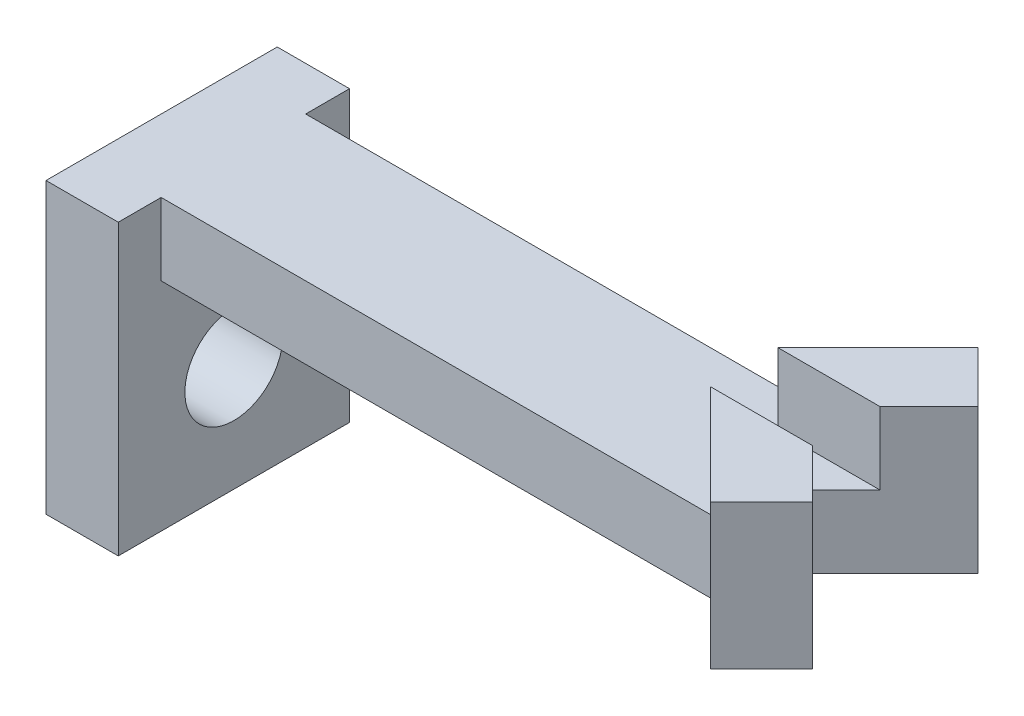
ISO-10303-21;
HEADER;
FILE_DESCRIPTION(('STEP AP214'),'2;1');
FILE_NAME('part.step','',(''),(''),'','','');
FILE_SCHEMA(('AUTOMOTIVE_DESIGN { 1 0 10303 214 1 1 1 1 }'));
ENDSEC;
DATA;
#1=APPLICATION_CONTEXT('core data for automotive mechanical design processes');
#2=APPLICATION_PROTOCOL_DEFINITION('international standard','automotive_design',2000,#1);
#3=PRODUCT_CONTEXT('',#1,'mechanical');
#4=PRODUCT('Part','Part','',(#3));
#5=PRODUCT_RELATED_PRODUCT_CATEGORY('part','',(#4));
#6=PRODUCT_DEFINITION_FORMATION('','',#4);
#7=PRODUCT_DEFINITION_CONTEXT('part definition',#1,'design');
#8=PRODUCT_DEFINITION('design','',#6,#7);
#9=PRODUCT_DEFINITION_SHAPE('','',#8);
#10=(LENGTH_UNIT() NAMED_UNIT(*) SI_UNIT(.MILLI.,.METRE.));
#11=(NAMED_UNIT(*) PLANE_ANGLE_UNIT() SI_UNIT($,.RADIAN.));
#12=(NAMED_UNIT(*) SI_UNIT($,.STERADIAN.) SOLID_ANGLE_UNIT());
#13=UNCERTAINTY_MEASURE_WITH_UNIT(LENGTH_MEASURE(1.E-05),#10,'distance_accuracy_value','');
#14=(GEOMETRIC_REPRESENTATION_CONTEXT(3) GLOBAL_UNCERTAINTY_ASSIGNED_CONTEXT((#13)) GLOBAL_UNIT_ASSIGNED_CONTEXT((#10,
#11,#12)) REPRESENTATION_CONTEXT('',''));
#15=CARTESIAN_POINT('',(0.,0.,0.));
#16=DIRECTION('',(0.,0.,1.));
#17=DIRECTION('',(1.,0.,0.));
#18=AXIS2_PLACEMENT_3D('',#15,#16,#17);
#19=CARTESIAN_POINT('',(0.,3.175,0.));
#20=DIRECTION('',(0.,-1.,0.));
#21=DIRECTION('',(0.,0.,-1.));
#22=AXIS2_PLACEMENT_3D('',#19,#20,#21);
#23=PLANE('',#22);
#24=DIRECTION('',(1.,0.,0.));
#25=VECTOR('',#24,1.);
#26=CARTESIAN_POINT('',(-11.4286567576271,3.175,-3.15452605038283));
#27=LINE('',#26,#25);
#28=CARTESIAN_POINT('',(-8.25365675762713,3.175,-3.15452605038283));
#29=VERTEX_POINT('',#28);
#30=CARTESIAN_POINT('',(15.8763432423729,3.175,-3.15452605038283));
#31=VERTEX_POINT('',#30);
#32=EDGE_CURVE('E285',#29,#31,#27,.T.);
#33=ORIENTED_EDGE('',*,*,#32,.F.);
#34=DIRECTION('',(0.,0.,-1.));
#35=VECTOR('',#34,1.);
#36=CARTESIAN_POINT('',(-8.25365675762713,3.175,-5.08));
#37=LINE('',#36,#35);
#38=CARTESIAN_POINT('',(-8.25365675762713,3.175,-5.08));
#39=VERTEX_POINT('',#38);
#40=EDGE_CURVE('E205',#29,#39,#37,.T.);
#41=ORIENTED_EDGE('',*,*,#40,.T.);
#42=DIRECTION('',(-1.,0.,0.));
#43=VECTOR('',#42,1.);
#44=CARTESIAN_POINT('',(-11.4286567576271,3.175,-5.08));
#45=LINE('',#44,#43);
#46=CARTESIAN_POINT('',(-11.4286567576271,3.175,-5.08));
#47=VERTEX_POINT('',#46);
#48=EDGE_CURVE('E165',#39,#47,#45,.T.);
#49=ORIENTED_EDGE('',*,*,#48,.T.);
#50=DIRECTION('',(0.,0.,1.));
#51=VECTOR('',#50,1.);
#52=CARTESIAN_POINT('',(-11.4286567576271,3.175,3.19547394961717));
#53=LINE('',#52,#51);
#54=CARTESIAN_POINT('',(-11.4286567576271,3.175,5.08));
#55=VERTEX_POINT('',#54);
#56=EDGE_CURVE('E313',#47,#55,#53,.T.);
#57=ORIENTED_EDGE('',*,*,#56,.T.);
#58=DIRECTION('',(1.,0.,0.));
#59=VECTOR('',#58,1.);
#60=CARTESIAN_POINT('',(-11.4286567576271,3.175,5.08));
#61=LINE('',#60,#59);
#62=CARTESIAN_POINT('',(-8.25365675762713,3.175,5.08));
#63=VERTEX_POINT('',#62);
#64=EDGE_CURVE('E188',#55,#63,#61,.T.);
#65=ORIENTED_EDGE('',*,*,#64,.T.);
#66=CARTESIAN_POINT('',(-8.25365675762713,3.175,3.19547394961717));
#67=VERTEX_POINT('',#66);
#68=EDGE_CURVE('E201',#63,#67,#37,.T.);
#69=ORIENTED_EDGE('',*,*,#68,.T.);
#70=DIRECTION('',(1.,0.,0.));
#71=VECTOR('',#70,1.);
#72=CARTESIAN_POINT('',(-11.4286567576271,3.175,3.19547394961717));
#73=LINE('',#72,#71);
#74=CARTESIAN_POINT('',(15.8763432423729,3.175,3.19547394961717));
#75=VERTEX_POINT('',#74);
#76=EDGE_CURVE('E56',#67,#75,#73,.T.);
#77=ORIENTED_EDGE('',*,*,#76,.T.);
#78=DIRECTION('',(0.707106781186548,0.,0.707106781186547));
#79=VECTOR('',#78,1.);
#80=CARTESIAN_POINT('',(18.580775447712,3.175,5.89990615495623));
#81=LINE('',#80,#79);
#82=CARTESIAN_POINT('',(14.1855372502087,3.175,1.50466795745288));
#83=VERTEX_POINT('',#82);
#84=EDGE_CURVE('E257',#83,#75,#81,.T.);
#85=ORIENTED_EDGE('',*,*,#84,.F.);
#86=DIRECTION('',(-1.,0.,0.));
#87=VECTOR('',#86,1.);
#88=CARTESIAN_POINT('',(14.1855372502087,3.175,1.50466795745288));
#89=LINE('',#88,#87);
#90=CARTESIAN_POINT('',(18.6756653107431,3.175,1.50466795745274));
#91=VERTEX_POINT('',#90);
#92=EDGE_CURVE('E251',#91,#83,#89,.T.);
#93=ORIENTED_EDGE('',*,*,#92,.F.);
#94=DIRECTION('',(-0.707106781186552,0.,-0.707106781186543));
#95=VECTOR('',#94,1.);
#96=CARTESIAN_POINT('',(20.8258394779794,3.175,3.65484212468901));
#97=LINE('',#96,#95);
#98=CARTESIAN_POINT('',(17.1914713029075,3.175,0.0204739496171711));
#99=VERTEX_POINT('',#98);
#100=EDGE_CURVE('E319',#91,#99,#97,.T.);
#101=ORIENTED_EDGE('',*,*,#100,.T.);
#102=DIRECTION('',(-0.707106781186552,0.,0.707106781186543));
#103=VECTOR('',#102,1.);
#104=CARTESIAN_POINT('',(20.8258394779794,3.175,-3.61389422545467));
#105=LINE('',#104,#103);
#106=CARTESIAN_POINT('',(18.6756653107431,3.175,-1.4637200582184));
#107=VERTEX_POINT('',#106);
#108=EDGE_CURVE('E282',#107,#99,#105,.T.);
#109=ORIENTED_EDGE('',*,*,#108,.F.);
#110=DIRECTION('',(1.,0.,0.));
#111=VECTOR('',#110,1.);
#112=CARTESIAN_POINT('',(14.1855372502087,3.175,-1.46372005821854));
#113=LINE('',#112,#111);
#114=CARTESIAN_POINT('',(14.1855372502087,3.175,-1.46372005821854));
#115=VERTEX_POINT('',#114);
#116=EDGE_CURVE('E222',#115,#107,#113,.T.);
#117=ORIENTED_EDGE('',*,*,#116,.F.);
#118=DIRECTION('',(-0.707106781186547,0.,0.707106781186547));
#119=VECTOR('',#118,1.);
#120=CARTESIAN_POINT('',(18.580775447712,3.175,-5.85895825572189));
#121=LINE('',#120,#119);
#122=EDGE_CURVE('E228',#31,#115,#121,.T.);
#123=ORIENTED_EDGE('',*,*,#122,.F.);
#124=EDGE_LOOP('',(#33,#41,#49,#57,#65,#69,#77,#85,#93,#101,#109,#117,#123));
#125=FACE_BOUND('',#124,.T.);
#126=ADVANCED_FACE('F40',(#125),#23,.F.);
#127=CARTESIAN_POINT('',(-11.4286567576271,3.175,3.19547394961717));
#128=DIRECTION('',(1.,0.,0.));
#129=DIRECTION('',(0.,0.,-1.));
#130=AXIS2_PLACEMENT_3D('',#127,#128,#129);
#131=PLANE('',#130);
#132=CARTESIAN_POINT('',(-11.4286567576271,-4.7625,0.));
#133=DIRECTION('',(1.,0.,0.));
#134=DIRECTION('',(0.,0.,-1.));
#135=AXIS2_PLACEMENT_3D('',#132,#133,#134);
#136=CIRCLE('',#135,2.15265);
#137=CARTESIAN_POINT('',(-11.4286567576271,-4.7625,-2.15265));
#138=VERTEX_POINT('',#137);
#139=EDGE_CURVE('E194',#138,#138,#136,.T.);
#140=ORIENTED_EDGE('',*,*,#139,.T.);
#141=EDGE_LOOP('',(#140));
#142=FACE_BOUND('',#141,.T.);
#143=DIRECTION('',(0.,1.,0.));
#144=VECTOR('',#143,1.);
#145=CARTESIAN_POINT('',(-11.4286567576271,-9.525,5.08));
#146=LINE('',#145,#144);
#147=CARTESIAN_POINT('',(-11.4286567576271,-9.525,5.08));
#148=VERTEX_POINT('',#147);
#149=EDGE_CURVE('E211',#148,#55,#146,.T.);
#150=ORIENTED_EDGE('',*,*,#149,.T.);
#151=ORIENTED_EDGE('',*,*,#56,.F.);
#152=DIRECTION('',(0.,1.,0.));
#153=VECTOR('',#152,1.);
#154=CARTESIAN_POINT('',(-11.4286567576271,-9.525,-5.08));
#155=LINE('',#154,#153);
#156=CARTESIAN_POINT('',(-11.4286567576271,-9.525,-5.08));
#157=VERTEX_POINT('',#156);
#158=EDGE_CURVE('E170',#157,#47,#155,.T.);
#159=ORIENTED_EDGE('',*,*,#158,.F.);
#160=DIRECTION('',(0.,0.,1.));
#161=VECTOR('',#160,1.);
#162=CARTESIAN_POINT('',(-11.4286567576271,-9.525,-5.08));
#163=LINE('',#162,#161);
#164=EDGE_CURVE('E181',#157,#148,#163,.T.);
#165=ORIENTED_EDGE('',*,*,#164,.T.);
#166=EDGE_LOOP('',(#150,#151,#159,#165));
#167=FACE_BOUND('',#166,.T.);
#168=ADVANCED_FACE('F42',(#142,#167),#131,.F.);
#169=CARTESIAN_POINT('',(-11.4286567576271,3.175,3.19547394961717));
#170=DIRECTION('',(0.,0.,-1.));
#171=DIRECTION('',(-1.,0.,0.));
#172=AXIS2_PLACEMENT_3D('',#169,#170,#171);
#173=PLANE('',#172);
#174=ORIENTED_EDGE('',*,*,#76,.F.);
#175=DIRECTION('',(0.,-1.,0.));
#176=VECTOR('',#175,1.);
#177=CARTESIAN_POINT('',(-8.25365675762713,3.175,3.19547394961717));
#178=LINE('',#177,#176);
#179=CARTESIAN_POINT('',(-8.25365675762713,0.,3.19547394961717));
#180=VERTEX_POINT('',#179);
#181=EDGE_CURVE('E60',#67,#180,#178,.T.);
#182=ORIENTED_EDGE('',*,*,#181,.T.);
#183=DIRECTION('',(1.,0.,0.));
#184=VECTOR('',#183,1.);
#185=CARTESIAN_POINT('',(-11.4286567576271,0.,3.19547394961717));
#186=LINE('',#185,#184);
#187=CARTESIAN_POINT('',(15.8763432423729,0.,3.19547394961717));
#188=VERTEX_POINT('',#187);
#189=EDGE_CURVE('E312',#180,#188,#186,.T.);
#190=ORIENTED_EDGE('',*,*,#189,.T.);
#191=DIRECTION('',(0.,-1.,0.));
#192=VECTOR('',#191,1.);
#193=CARTESIAN_POINT('',(15.8763432423729,3.175,3.19547394961717));
#194=LINE('',#193,#192);
#195=EDGE_CURVE('E49',#75,#188,#194,.T.);
#196=ORIENTED_EDGE('',*,*,#195,.F.);
#197=EDGE_LOOP('',(#174,#182,#190,#196));
#198=FACE_BOUND('',#197,.T.);
#199=ADVANCED_FACE('F424',(#198),#173,.F.);
#200=CARTESIAN_POINT('',(15.8763432423729,3.175,3.19547394961717));
#201=DIRECTION('',(0.707106781186542,0.,-0.707106781186553));
#202=DIRECTION('',(-0.707106781186553,0.,-0.707106781186542));
#203=AXIS2_PLACEMENT_3D('',#200,#201,#202);
#204=PLANE('',#203);
#205=DIRECTION('',(0.707106781186553,0.,0.707106781186542));
#206=VECTOR('',#205,1.);
#207=CARTESIAN_POINT('',(15.8763432423729,0.,3.19547394961717));
#208=LINE('',#207,#206);
#209=CARTESIAN_POINT('',(18.5807754477121,0.,5.89990615495631));
#210=VERTEX_POINT('',#209);
#211=EDGE_CURVE('E326',#188,#210,#208,.T.);
#212=ORIENTED_EDGE('',*,*,#211,.T.);
#213=DIRECTION('',(0.,-1.,0.));
#214=VECTOR('',#213,1.);
#215=CARTESIAN_POINT('',(18.5807754477121,3.175,5.89990615495631));
#216=LINE('',#215,#214);
#217=CARTESIAN_POINT('',(18.580775447712,6.35,5.89990615495623));
#218=VERTEX_POINT('',#217);
#219=EDGE_CURVE('E341',#218,#210,#216,.T.);
#220=ORIENTED_EDGE('',*,*,#219,.F.);
#221=DIRECTION('',(0.707106781186548,0.,0.707106781186547));
#222=VECTOR('',#221,1.);
#223=CARTESIAN_POINT('',(18.580775447712,6.35,5.89990615495623));
#224=LINE('',#223,#222);
#225=CARTESIAN_POINT('',(14.1855372502087,6.35,1.50466795745288));
#226=VERTEX_POINT('',#225);
#227=EDGE_CURVE('E263',#226,#218,#224,.T.);
#228=ORIENTED_EDGE('',*,*,#227,.F.);
#229=DIRECTION('',(0.,-1.,0.));
#230=VECTOR('',#229,1.);
#231=CARTESIAN_POINT('',(14.1855372502087,6.35,1.50466795745288));
#232=LINE('',#231,#230);
#233=EDGE_CURVE('E267',#226,#83,#232,.T.);
#234=ORIENTED_EDGE('',*,*,#233,.T.);
#235=ORIENTED_EDGE('',*,*,#84,.T.);
#236=ORIENTED_EDGE('',*,*,#195,.T.);
#237=EDGE_LOOP('',(#212,#220,#228,#234,#235,#236));
#238=FACE_BOUND('',#237,.T.);
#239=ADVANCED_FACE('F348',(#238),#204,.F.);
#240=CARTESIAN_POINT('',(18.5807754477121,3.175,5.89990615495631));
#241=DIRECTION('',(-0.707106781186553,0.,-0.707106781186542));
#242=DIRECTION('',(-0.707106781186542,0.,0.707106781186553));
#243=AXIS2_PLACEMENT_3D('',#240,#241,#242);
#244=PLANE('',#243);
#245=DIRECTION('',(0.707106781186542,0.,-0.707106781186553));
#246=VECTOR('',#245,1.);
#247=CARTESIAN_POINT('',(18.5807754477121,0.,5.89990615495631));
#248=LINE('',#247,#246);
#249=CARTESIAN_POINT('',(20.8258394779794,0.,3.65484212468901));
#250=VERTEX_POINT('',#249);
#251=EDGE_CURVE('E329',#210,#250,#248,.T.);
#252=ORIENTED_EDGE('',*,*,#251,.T.);
#253=DIRECTION('',(0.,-1.,0.));
#254=VECTOR('',#253,1.);
#255=CARTESIAN_POINT('',(20.8258394779794,3.175,3.65484212468901));
#256=LINE('',#255,#254);
#257=CARTESIAN_POINT('',(20.8258394779794,6.35,3.65484212468901));
#258=VERTEX_POINT('',#257);
#259=EDGE_CURVE('E337',#258,#250,#256,.T.);
#260=ORIENTED_EDGE('',*,*,#259,.F.);
#261=DIRECTION('',(0.707106781186569,0.,-0.707106781186526));
#262=VECTOR('',#261,1.);
#263=CARTESIAN_POINT('',(20.8258394779794,6.35,3.65484212468901));
#264=LINE('',#263,#262);
#265=EDGE_CURVE('E252',#218,#258,#264,.T.);
#266=ORIENTED_EDGE('',*,*,#265,.F.);
#267=ORIENTED_EDGE('',*,*,#219,.T.);
#268=EDGE_LOOP('',(#252,#260,#266,#267));
#269=FACE_BOUND('',#268,.T.);
#270=ADVANCED_FACE('F354',(#269),#244,.F.);
#271=CARTESIAN_POINT('',(20.8258394779794,3.175,3.65484212468901));
#272=DIRECTION('',(-0.707106781186543,0.,0.707106781186552));
#273=DIRECTION('',(0.707106781186552,0.,0.707106781186543));
#274=AXIS2_PLACEMENT_3D('',#271,#272,#273);
#275=PLANE('',#274);
#276=DIRECTION('',(-0.707106781186552,0.,-0.707106781186543));
#277=VECTOR('',#276,1.);
#278=CARTESIAN_POINT('',(20.8258394779794,0.,3.65484212468901));
#279=LINE('',#278,#277);
#280=CARTESIAN_POINT('',(17.1914713029075,0.,0.0204739496171711));
#281=VERTEX_POINT('',#280);
#282=EDGE_CURVE('E316',#250,#281,#279,.T.);
#283=ORIENTED_EDGE('',*,*,#282,.T.);
#284=DIRECTION('',(0.,-1.,0.));
#285=VECTOR('',#284,1.);
#286=CARTESIAN_POINT('',(17.1914713029075,3.175,0.0204739496171711));
#287=LINE('',#286,#285);
#288=EDGE_CURVE('E323',#99,#281,#287,.T.);
#289=ORIENTED_EDGE('',*,*,#288,.F.);
#290=ORIENTED_EDGE('',*,*,#100,.F.);
#291=DIRECTION('',(0.,-1.,0.));
#292=VECTOR('',#291,1.);
#293=CARTESIAN_POINT('',(18.6756653107431,6.35,1.50466795745274));
#294=LINE('',#293,#292);
#295=CARTESIAN_POINT('',(18.6756653107431,6.35,1.50466795745274));
#296=VERTEX_POINT('',#295);
#297=EDGE_CURVE('E277',#296,#91,#294,.T.);
#298=ORIENTED_EDGE('',*,*,#297,.F.);
#299=DIRECTION('',(-0.707106781186552,0.,-0.707106781186543));
#300=VECTOR('',#299,1.);
#301=CARTESIAN_POINT('',(18.6756653107431,6.35,1.50466795745274));
#302=LINE('',#301,#300);
#303=EDGE_CURVE('E256',#258,#296,#302,.T.);
#304=ORIENTED_EDGE('',*,*,#303,.F.);
#305=ORIENTED_EDGE('',*,*,#259,.T.);
#306=EDGE_LOOP('',(#283,#289,#290,#298,#304,#305));
#307=FACE_BOUND('',#306,.T.);
#308=ADVANCED_FACE('F358',(#307),#275,.F.);
#309=CARTESIAN_POINT('',(0.,0.,0.));
#310=DIRECTION('',(0.,-1.,0.));
#311=DIRECTION('',(0.,0.,-1.));
#312=AXIS2_PLACEMENT_3D('',#309,#310,#311);
#313=PLANE('',#312);
#314=DIRECTION('',(0.,0.,1.));
#315=VECTOR('',#314,1.);
#316=CARTESIAN_POINT('',(-8.25365675762713,0.,0.));
#317=LINE('',#316,#315);
#318=CARTESIAN_POINT('',(-8.25365675762713,0.,-3.15452605038283));
#319=VERTEX_POINT('',#318);
#320=EDGE_CURVE('E210',#319,#180,#317,.T.);
#321=ORIENTED_EDGE('',*,*,#320,.F.);
#322=DIRECTION('',(1.,0.,0.));
#323=VECTOR('',#322,1.);
#324=CARTESIAN_POINT('',(-11.4286567576271,0.,-3.15452605038283));
#325=LINE('',#324,#323);
#326=CARTESIAN_POINT('',(15.8763432423729,0.,-3.15452605038283));
#327=VERTEX_POINT('',#326);
#328=EDGE_CURVE('E286',#319,#327,#325,.T.);
#329=ORIENTED_EDGE('',*,*,#328,.T.);
#330=DIRECTION('',(0.707106781186553,0.,-0.707106781186542));
#331=VECTOR('',#330,1.);
#332=CARTESIAN_POINT('',(15.8763432423729,0.,-3.15452605038283));
#333=LINE('',#332,#331);
#334=CARTESIAN_POINT('',(18.5807754477121,0.,-5.85895825572197));
#335=VERTEX_POINT('',#334);
#336=EDGE_CURVE('E297',#327,#335,#333,.T.);
#337=ORIENTED_EDGE('',*,*,#336,.T.);
#338=DIRECTION('',(0.707106781186542,0.,0.707106781186553));
#339=VECTOR('',#338,1.);
#340=CARTESIAN_POINT('',(18.5807754477121,0.,-5.85895825572197));
#341=LINE('',#340,#339);
#342=CARTESIAN_POINT('',(20.8258394779794,0.,-3.61389422545467));
#343=VERTEX_POINT('',#342);
#344=EDGE_CURVE('E293',#335,#343,#341,.T.);
#345=ORIENTED_EDGE('',*,*,#344,.T.);
#346=DIRECTION('',(-0.707106781186552,0.,0.707106781186543));
#347=VECTOR('',#346,1.);
#348=CARTESIAN_POINT('',(20.8258394779794,0.,-3.61389422545467));
#349=LINE('',#348,#347);
#350=EDGE_CURVE('E281',#343,#281,#349,.T.);
#351=ORIENTED_EDGE('',*,*,#350,.T.);
#352=ORIENTED_EDGE('',*,*,#282,.F.);
#353=ORIENTED_EDGE('',*,*,#251,.F.);
#354=ORIENTED_EDGE('',*,*,#211,.F.);
#355=ORIENTED_EDGE('',*,*,#189,.F.);
#356=EDGE_LOOP('',(#321,#329,#337,#345,#351,#352,#353,#354,#355));
#357=FACE_BOUND('',#356,.T.);
#358=ADVANCED_FACE('F351',(#357),#313,.T.);
#359=CARTESIAN_POINT('',(20.8258394779794,3.175,-3.61389422545467));
#360=DIRECTION('',(0.707106781186543,0.,0.707106781186552));
#361=DIRECTION('',(0.707106781186552,0.,-0.707106781186543));
#362=AXIS2_PLACEMENT_3D('',#359,#360,#361);
#363=PLANE('',#362);
#364=ORIENTED_EDGE('',*,*,#350,.F.);
#365=DIRECTION('',(0.,-1.,0.));
#366=VECTOR('',#365,1.);
#367=CARTESIAN_POINT('',(20.8258394779794,3.175,-3.61389422545467));
#368=LINE('',#367,#366);
#369=CARTESIAN_POINT('',(20.8258394779794,6.35,-3.61389422545467));
#370=VERTEX_POINT('',#369);
#371=EDGE_CURVE('E309',#370,#343,#368,.T.);
#372=ORIENTED_EDGE('',*,*,#371,.F.);
#373=DIRECTION('',(0.707106781186552,0.,-0.707106781186543));
#374=VECTOR('',#373,1.);
#375=CARTESIAN_POINT('',(18.6756653107431,6.35,-1.4637200582184));
#376=LINE('',#375,#374);
#377=CARTESIAN_POINT('',(18.6756653107431,6.35,-1.4637200582184));
#378=VERTEX_POINT('',#377);
#379=EDGE_CURVE('E227',#378,#370,#376,.T.);
#380=ORIENTED_EDGE('',*,*,#379,.F.);
#381=DIRECTION('',(0.,-1.,0.));
#382=VECTOR('',#381,1.);
#383=CARTESIAN_POINT('',(18.6756653107431,6.35,-1.4637200582184));
#384=LINE('',#383,#382);
#385=EDGE_CURVE('E248',#378,#107,#384,.T.);
#386=ORIENTED_EDGE('',*,*,#385,.T.);
#387=ORIENTED_EDGE('',*,*,#108,.T.);
#388=ORIENTED_EDGE('',*,*,#288,.T.);
#389=EDGE_LOOP('',(#364,#372,#380,#386,#387,#388));
#390=FACE_BOUND('',#389,.T.);
#391=ADVANCED_FACE('F373',(#390),#363,.T.);
#392=CARTESIAN_POINT('',(18.5807754477121,3.175,-5.85895825572197));
#393=DIRECTION('',(0.707106781186553,0.,-0.707106781186542));
#394=DIRECTION('',(-0.707106781186542,0.,-0.707106781186553));
#395=AXIS2_PLACEMENT_3D('',#392,#393,#394);
#396=PLANE('',#395);
#397=ORIENTED_EDGE('',*,*,#344,.F.);
#398=DIRECTION('',(0.,-1.,0.));
#399=VECTOR('',#398,1.);
#400=CARTESIAN_POINT('',(18.5807754477121,3.175,-5.85895825572197));
#401=LINE('',#400,#399);
#402=CARTESIAN_POINT('',(18.580775447712,6.35,-5.85895825572189));
#403=VERTEX_POINT('',#402);
#404=EDGE_CURVE('E306',#403,#335,#401,.T.);
#405=ORIENTED_EDGE('',*,*,#404,.F.);
#406=DIRECTION('',(-0.707106781186569,0.,-0.707106781186526));
#407=VECTOR('',#406,1.);
#408=CARTESIAN_POINT('',(18.580775447712,6.35,-5.85895825572189));
#409=LINE('',#408,#407);
#410=EDGE_CURVE('E232',#370,#403,#409,.T.);
#411=ORIENTED_EDGE('',*,*,#410,.F.);
#412=ORIENTED_EDGE('',*,*,#371,.T.);
#413=EDGE_LOOP('',(#397,#405,#411,#412));
#414=FACE_BOUND('',#413,.T.);
#415=ADVANCED_FACE('F377',(#414),#396,.T.);
#416=CARTESIAN_POINT('',(15.8763432423729,3.175,-3.15452605038283));
#417=DIRECTION('',(-0.707106781186542,0.,-0.707106781186553));
#418=DIRECTION('',(-0.707106781186553,0.,0.707106781186542));
#419=AXIS2_PLACEMENT_3D('',#416,#417,#418);
#420=PLANE('',#419);
#421=ORIENTED_EDGE('',*,*,#336,.F.);
#422=DIRECTION('',(0.,-1.,0.));
#423=VECTOR('',#422,1.);
#424=CARTESIAN_POINT('',(15.8763432423729,3.175,-3.15452605038283));
#425=LINE('',#424,#423);
#426=EDGE_CURVE('E289',#31,#327,#425,.T.);
#427=ORIENTED_EDGE('',*,*,#426,.F.);
#428=ORIENTED_EDGE('',*,*,#122,.T.);
#429=DIRECTION('',(0.,-1.,0.));
#430=VECTOR('',#429,1.);
#431=CARTESIAN_POINT('',(14.1855372502087,6.35,-1.46372005821854));
#432=LINE('',#431,#430);
#433=CARTESIAN_POINT('',(14.1855372502087,6.35,-1.46372005821854));
#434=VERTEX_POINT('',#433);
#435=EDGE_CURVE('E239',#434,#115,#432,.T.);
#436=ORIENTED_EDGE('',*,*,#435,.F.);
#437=DIRECTION('',(-0.707106781186547,0.,0.707106781186547));
#438=VECTOR('',#437,1.);
#439=CARTESIAN_POINT('',(18.580775447712,6.35,-5.85895825572189));
#440=LINE('',#439,#438);
#441=EDGE_CURVE('E236',#403,#434,#440,.T.);
#442=ORIENTED_EDGE('',*,*,#441,.F.);
#443=ORIENTED_EDGE('',*,*,#404,.T.);
#444=EDGE_LOOP('',(#421,#427,#428,#436,#442,#443));
#445=FACE_BOUND('',#444,.T.);
#446=ADVANCED_FACE('F392',(#445),#420,.T.);
#447=CARTESIAN_POINT('',(-11.4286567576271,3.175,-3.15452605038283));
#448=DIRECTION('',(0.,0.,-1.));
#449=DIRECTION('',(-1.,0.,0.));
#450=AXIS2_PLACEMENT_3D('',#447,#448,#449);
#451=PLANE('',#450);
#452=DIRECTION('',(0.,-1.,0.));
#453=VECTOR('',#452,1.);
#454=CARTESIAN_POINT('',(-8.25365675762713,3.175,-3.15452605038283));
#455=LINE('',#454,#453);
#456=EDGE_CURVE('E11',#29,#319,#455,.T.);
#457=ORIENTED_EDGE('',*,*,#456,.F.);
#458=ORIENTED_EDGE('',*,*,#32,.T.);
#459=ORIENTED_EDGE('',*,*,#426,.T.);
#460=ORIENTED_EDGE('',*,*,#328,.F.);
#461=EDGE_LOOP('',(#457,#458,#459,#460));
#462=FACE_BOUND('',#461,.T.);
#463=ADVANCED_FACE('F395',(#462),#451,.T.);
#464=CARTESIAN_POINT('',(14.1855372502087,6.35,1.50466795745288));
#465=DIRECTION('',(0.,0.,1.));
#466=DIRECTION('',(1.,0.,0.));
#467=AXIS2_PLACEMENT_3D('',#464,#465,#466);
#468=PLANE('',#467);
#469=ORIENTED_EDGE('',*,*,#92,.T.);
#470=ORIENTED_EDGE('',*,*,#233,.F.);
#471=DIRECTION('',(-1.,0.,0.));
#472=VECTOR('',#471,1.);
#473=CARTESIAN_POINT('',(14.1855372502087,6.35,1.50466795745288));
#474=LINE('',#473,#472);
#475=EDGE_CURVE('E260',#296,#226,#474,.T.);
#476=ORIENTED_EDGE('',*,*,#475,.F.);
#477=ORIENTED_EDGE('',*,*,#297,.T.);
#478=EDGE_LOOP('',(#469,#470,#476,#477));
#479=FACE_BOUND('',#478,.T.);
#480=ADVANCED_FACE('F368',(#479),#468,.F.);
#481=CARTESIAN_POINT('',(0.,6.35,0.));
#482=DIRECTION('',(0.,-1.,0.));
#483=DIRECTION('',(0.,0.,-1.));
#484=AXIS2_PLACEMENT_3D('',#481,#482,#483);
#485=PLANE('',#484);
#486=ORIENTED_EDGE('',*,*,#265,.T.);
#487=ORIENTED_EDGE('',*,*,#303,.T.);
#488=ORIENTED_EDGE('',*,*,#475,.T.);
#489=ORIENTED_EDGE('',*,*,#227,.T.);
#490=EDGE_LOOP('',(#486,#487,#488,#489));
#491=FACE_BOUND('',#490,.T.);
#492=ADVANCED_FACE('F364',(#491),#485,.F.);
#493=CARTESIAN_POINT('',(14.1855372502087,6.35,-1.46372005821854));
#494=DIRECTION('',(0.,0.,-1.));
#495=DIRECTION('',(-1.,0.,0.));
#496=AXIS2_PLACEMENT_3D('',#493,#494,#495);
#497=PLANE('',#496);
#498=ORIENTED_EDGE('',*,*,#116,.T.);
#499=ORIENTED_EDGE('',*,*,#385,.F.);
#500=DIRECTION('',(1.,0.,0.));
#501=VECTOR('',#500,1.);
#502=CARTESIAN_POINT('',(14.1855372502087,6.35,-1.46372005821854));
#503=LINE('',#502,#501);
#504=EDGE_CURVE('E223',#434,#378,#503,.T.);
#505=ORIENTED_EDGE('',*,*,#504,.F.);
#506=ORIENTED_EDGE('',*,*,#435,.T.);
#507=EDGE_LOOP('',(#498,#499,#505,#506));
#508=FACE_BOUND('',#507,.T.);
#509=ADVANCED_FACE('F386',(#508),#497,.F.);
#510=CARTESIAN_POINT('',(0.,6.35,0.));
#511=DIRECTION('',(0.,1.,0.));
#512=DIRECTION('',(0.,0.,1.));
#513=AXIS2_PLACEMENT_3D('',#510,#511,#512);
#514=PLANE('',#513);
#515=ORIENTED_EDGE('',*,*,#504,.T.);
#516=ORIENTED_EDGE('',*,*,#379,.T.);
#517=ORIENTED_EDGE('',*,*,#410,.T.);
#518=ORIENTED_EDGE('',*,*,#441,.T.);
#519=EDGE_LOOP('',(#515,#516,#517,#518));
#520=FACE_BOUND('',#519,.T.);
#521=ADVANCED_FACE('F380',(#520),#514,.T.);
#522=CARTESIAN_POINT('',(-8.25365675762713,-9.525,-5.08));
#523=DIRECTION('',(1.,0.,0.));
#524=DIRECTION('',(0.,0.,-1.));
#525=AXIS2_PLACEMENT_3D('',#522,#523,#524);
#526=PLANE('',#525);
#527=CARTESIAN_POINT('',(-8.25365675762713,-4.7625,0.));
#528=DIRECTION('',(1.,0.,0.));
#529=DIRECTION('',(0.,0.,-1.));
#530=AXIS2_PLACEMENT_3D('',#527,#528,#529);
#531=CIRCLE('',#530,2.15264999999999);
#532=CARTESIAN_POINT('',(-8.25365675762713,-4.7625,-2.15264999999999));
#533=VERTEX_POINT('',#532);
#534=EDGE_CURVE('E399',#533,#533,#531,.T.);
#535=ORIENTED_EDGE('',*,*,#534,.F.);
#536=EDGE_LOOP('',(#535));
#537=FACE_BOUND('',#536,.T.);
#538=ORIENTED_EDGE('',*,*,#181,.F.);
#539=ORIENTED_EDGE('',*,*,#68,.F.);
#540=DIRECTION('',(0.,1.,0.));
#541=VECTOR('',#540,1.);
#542=CARTESIAN_POINT('',(-8.25365675762713,-9.525,5.08));
#543=LINE('',#542,#541);
#544=CARTESIAN_POINT('',(-8.25365675762713,-9.525,5.08));
#545=VERTEX_POINT('',#544);
#546=EDGE_CURVE('E186',#545,#63,#543,.T.);
#547=ORIENTED_EDGE('',*,*,#546,.F.);
#548=DIRECTION('',(0.,0.,-1.));
#549=VECTOR('',#548,1.);
#550=CARTESIAN_POINT('',(-8.25365675762713,-9.525,-5.08));
#551=LINE('',#550,#549);
#552=CARTESIAN_POINT('',(-8.25365675762713,-9.525,-5.08));
#553=VERTEX_POINT('',#552);
#554=EDGE_CURVE('E178',#545,#553,#551,.T.);
#555=ORIENTED_EDGE('',*,*,#554,.T.);
#556=DIRECTION('',(0.,1.,0.));
#557=VECTOR('',#556,1.);
#558=CARTESIAN_POINT('',(-8.25365675762713,-9.525,-5.08));
#559=LINE('',#558,#557);
#560=EDGE_CURVE('E159',#553,#39,#559,.T.);
#561=ORIENTED_EDGE('',*,*,#560,.T.);
#562=ORIENTED_EDGE('',*,*,#40,.F.);
#563=ORIENTED_EDGE('',*,*,#456,.T.);
#564=ORIENTED_EDGE('',*,*,#320,.T.);
#565=EDGE_LOOP('',(#538,#539,#547,#555,#561,#562,#563,#564));
#566=FACE_BOUND('',#565,.T.);
#567=ADVANCED_FACE('F184',(#537,#566),#526,.T.);
#568=CARTESIAN_POINT('',(-11.4286567576271,-9.525,5.08));
#569=DIRECTION('',(0.,0.,1.));
#570=DIRECTION('',(1.,0.,0.));
#571=AXIS2_PLACEMENT_3D('',#568,#569,#570);
#572=PLANE('',#571);
#573=ORIENTED_EDGE('',*,*,#64,.F.);
#574=ORIENTED_EDGE('',*,*,#149,.F.);
#575=DIRECTION('',(1.,0.,0.));
#576=VECTOR('',#575,1.);
#577=CARTESIAN_POINT('',(-11.4286567576271,-9.525,5.08));
#578=LINE('',#577,#576);
#579=EDGE_CURVE('E171',#148,#545,#578,.T.);
#580=ORIENTED_EDGE('',*,*,#579,.T.);
#581=ORIENTED_EDGE('',*,*,#546,.T.);
#582=EDGE_LOOP('',(#573,#574,#580,#581));
#583=FACE_BOUND('',#582,.T.);
#584=ADVANCED_FACE('F409',(#583),#572,.T.);
#585=CARTESIAN_POINT('',(-11.4286567576271,-9.525,-5.08));
#586=DIRECTION('',(0.,0.,-1.));
#587=DIRECTION('',(-1.,0.,0.));
#588=AXIS2_PLACEMENT_3D('',#585,#586,#587);
#589=PLANE('',#588);
#590=ORIENTED_EDGE('',*,*,#48,.F.);
#591=ORIENTED_EDGE('',*,*,#560,.F.);
#592=DIRECTION('',(-1.,0.,0.));
#593=VECTOR('',#592,1.);
#594=CARTESIAN_POINT('',(-11.4286567576271,-9.525,-5.08));
#595=LINE('',#594,#593);
#596=EDGE_CURVE('E163',#553,#157,#595,.T.);
#597=ORIENTED_EDGE('',*,*,#596,.T.);
#598=ORIENTED_EDGE('',*,*,#158,.T.);
#599=EDGE_LOOP('',(#590,#591,#597,#598));
#600=FACE_BOUND('',#599,.T.);
#601=ADVANCED_FACE('F161',(#600),#589,.T.);
#602=CARTESIAN_POINT('',(0.,-9.525,0.));
#603=DIRECTION('',(0.,1.,0.));
#604=DIRECTION('',(0.,0.,1.));
#605=AXIS2_PLACEMENT_3D('',#602,#603,#604);
#606=PLANE('',#605);
#607=ORIENTED_EDGE('',*,*,#554,.F.);
#608=ORIENTED_EDGE('',*,*,#579,.F.);
#609=ORIENTED_EDGE('',*,*,#164,.F.);
#610=ORIENTED_EDGE('',*,*,#596,.F.);
#611=EDGE_LOOP('',(#607,#608,#609,#610));
#612=FACE_BOUND('',#611,.T.);
#613=ADVANCED_FACE('F176',(#612),#606,.F.);
#614=CARTESIAN_POINT('',(-8.25365675762713,-4.7625,0.));
#615=DIRECTION('',(1.,0.,0.));
#616=DIRECTION('',(0.,0.,-1.));
#617=AXIS2_PLACEMENT_3D('',#614,#615,#616);
#618=CYLINDRICAL_SURFACE('',#617,2.15264999999999);
#619=ORIENTED_EDGE('',*,*,#139,.F.);
#620=EDGE_LOOP('',(#619));
#621=FACE_BOUND('',#620,.T.);
#622=ORIENTED_EDGE('',*,*,#534,.T.);
#623=EDGE_LOOP('',(#622));
#624=FACE_BOUND('',#623,.T.);
#625=ADVANCED_FACE('F406',(#621,#624),#618,.F.);
#626=CLOSED_SHELL('',(#126,#168,#199,#239,#270,#308,#358,#391,#415,#446,#463,#480,#492,#509,
#521,#567,#584,#601,#613,#625));
#627=MANIFOLD_SOLID_BREP('B2',#626);
#628=ADVANCED_BREP_SHAPE_REPRESENTATION('',(#18,#627),#14);
#629=SHAPE_DEFINITION_REPRESENTATION(#9,#628);
ENDSEC;
END-ISO-10303-21;
